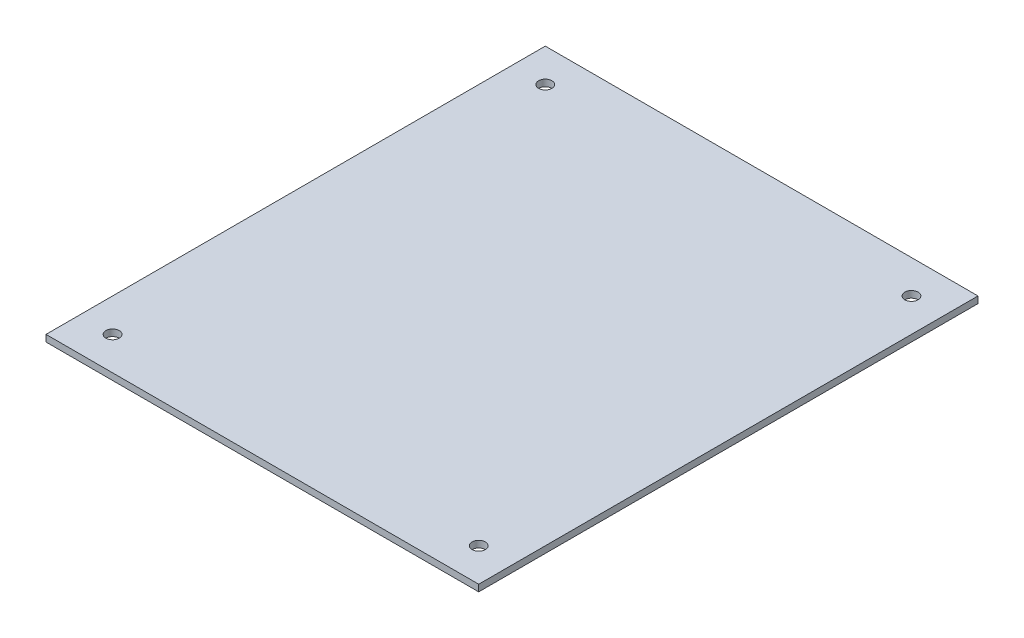
ISO-10303-21;
HEADER;
FILE_DESCRIPTION(('STEP AP214'),'2;1');
FILE_NAME('part.step','',(''),(''),'','','');
FILE_SCHEMA(('AUTOMOTIVE_DESIGN { 1 0 10303 214 1 1 1 1 }'));
ENDSEC;
DATA;
#1=APPLICATION_CONTEXT('core data for automotive mechanical design processes');
#2=APPLICATION_PROTOCOL_DEFINITION('international standard','automotive_design',2000,#1);
#3=PRODUCT_CONTEXT('',#1,'mechanical');
#4=PRODUCT('Part','Part','',(#3));
#5=PRODUCT_RELATED_PRODUCT_CATEGORY('part','',(#4));
#6=PRODUCT_DEFINITION_FORMATION('','',#4);
#7=PRODUCT_DEFINITION_CONTEXT('part definition',#1,'design');
#8=PRODUCT_DEFINITION('design','',#6,#7);
#9=PRODUCT_DEFINITION_SHAPE('','',#8);
#10=(LENGTH_UNIT() NAMED_UNIT(*) SI_UNIT(.MILLI.,.METRE.));
#11=(NAMED_UNIT(*) PLANE_ANGLE_UNIT() SI_UNIT($,.RADIAN.));
#12=(NAMED_UNIT(*) SI_UNIT($,.STERADIAN.) SOLID_ANGLE_UNIT());
#13=UNCERTAINTY_MEASURE_WITH_UNIT(LENGTH_MEASURE(1.E-05),#10,'distance_accuracy_value','');
#14=(GEOMETRIC_REPRESENTATION_CONTEXT(3) GLOBAL_UNCERTAINTY_ASSIGNED_CONTEXT((#13)) GLOBAL_UNIT_ASSIGNED_CONTEXT((#10,
#11,#12)) REPRESENTATION_CONTEXT('',''));
#15=CARTESIAN_POINT('',(0.,0.,0.));
#16=DIRECTION('',(0.,0.,1.));
#17=DIRECTION('',(1.,0.,0.));
#18=AXIS2_PLACEMENT_3D('',#15,#16,#17);
#19=CARTESIAN_POINT('',(65.,2.,75.));
#20=DIRECTION('',(-1.,0.,0.));
#21=DIRECTION('',(0.,0.,1.));
#22=AXIS2_PLACEMENT_3D('',#19,#20,#21);
#23=PLANE('',#22);
#24=DIRECTION('',(0.,0.,-1.));
#25=VECTOR('',#24,1.);
#26=CARTESIAN_POINT('',(65.,0.,75.));
#27=LINE('',#26,#25);
#28=CARTESIAN_POINT('',(65.,0.,75.));
#29=VERTEX_POINT('',#28);
#30=CARTESIAN_POINT('',(65.,0.,-75.));
#31=VERTEX_POINT('',#30);
#32=EDGE_CURVE('E96',#29,#31,#27,.T.);
#33=ORIENTED_EDGE('',*,*,#32,.T.);
#34=DIRECTION('',(0.,-1.,0.));
#35=VECTOR('',#34,1.);
#36=CARTESIAN_POINT('',(65.,2.,-75.));
#37=LINE('',#36,#35);
#38=CARTESIAN_POINT('',(65.,2.,-75.));
#39=VERTEX_POINT('',#38);
#40=EDGE_CURVE('E11',#39,#31,#37,.T.);
#41=ORIENTED_EDGE('',*,*,#40,.F.);
#42=DIRECTION('',(0.,0.,-1.));
#43=VECTOR('',#42,1.);
#44=CARTESIAN_POINT('',(65.,2.,75.));
#45=LINE('',#44,#43);
#46=CARTESIAN_POINT('',(65.,2.,75.));
#47=VERTEX_POINT('',#46);
#48=EDGE_CURVE('E84',#47,#39,#45,.T.);
#49=ORIENTED_EDGE('',*,*,#48,.F.);
#50=DIRECTION('',(0.,-1.,0.));
#51=VECTOR('',#50,1.);
#52=CARTESIAN_POINT('',(65.,2.,75.));
#53=LINE('',#52,#51);
#54=EDGE_CURVE('E92',#47,#29,#53,.T.);
#55=ORIENTED_EDGE('',*,*,#54,.T.);
#56=EDGE_LOOP('',(#33,#41,#49,#55));
#57=FACE_BOUND('',#56,.T.);
#58=ADVANCED_FACE('F33',(#57),#23,.F.);
#59=CARTESIAN_POINT('',(-65.,2.,-75.));
#60=DIRECTION('',(0.,0.,1.));
#61=DIRECTION('',(1.,0.,0.));
#62=AXIS2_PLACEMENT_3D('',#59,#60,#61);
#63=PLANE('',#62);
#64=DIRECTION('',(-1.,0.,0.));
#65=VECTOR('',#64,1.);
#66=CARTESIAN_POINT('',(-65.,0.,-75.));
#67=LINE('',#66,#65);
#68=CARTESIAN_POINT('',(-65.,0.,-75.));
#69=VERTEX_POINT('',#68);
#70=EDGE_CURVE('E88',#31,#69,#67,.T.);
#71=ORIENTED_EDGE('',*,*,#70,.T.);
#72=DIRECTION('',(0.,-1.,0.));
#73=VECTOR('',#72,1.);
#74=CARTESIAN_POINT('',(-65.,2.,-75.));
#75=LINE('',#74,#73);
#76=CARTESIAN_POINT('',(-65.,2.,-75.));
#77=VERTEX_POINT('',#76);
#78=EDGE_CURVE('E41',#77,#69,#75,.T.);
#79=ORIENTED_EDGE('',*,*,#78,.F.);
#80=DIRECTION('',(-1.,0.,0.));
#81=VECTOR('',#80,1.);
#82=CARTESIAN_POINT('',(-65.,2.,-75.));
#83=LINE('',#82,#81);
#84=EDGE_CURVE('E79',#39,#77,#83,.T.);
#85=ORIENTED_EDGE('',*,*,#84,.F.);
#86=ORIENTED_EDGE('',*,*,#40,.T.);
#87=EDGE_LOOP('',(#71,#79,#85,#86));
#88=FACE_BOUND('',#87,.T.);
#89=ADVANCED_FACE('F87',(#88),#63,.F.);
#90=CARTESIAN_POINT('',(-65.,2.,75.));
#91=DIRECTION('',(1.,0.,0.));
#92=DIRECTION('',(0.,0.,-1.));
#93=AXIS2_PLACEMENT_3D('',#90,#91,#92);
#94=PLANE('',#93);
#95=DIRECTION('',(0.,0.,1.));
#96=VECTOR('',#95,1.);
#97=CARTESIAN_POINT('',(-65.,0.,75.));
#98=LINE('',#97,#96);
#99=CARTESIAN_POINT('',(-65.,0.,75.));
#100=VERTEX_POINT('',#99);
#101=EDGE_CURVE('E66',#69,#100,#98,.T.);
#102=ORIENTED_EDGE('',*,*,#101,.T.);
#103=DIRECTION('',(0.,-1.,0.));
#104=VECTOR('',#103,1.);
#105=CARTESIAN_POINT('',(-65.,2.,75.));
#106=LINE('',#105,#104);
#107=CARTESIAN_POINT('',(-65.,2.,75.));
#108=VERTEX_POINT('',#107);
#109=EDGE_CURVE('E89',#108,#100,#106,.T.);
#110=ORIENTED_EDGE('',*,*,#109,.F.);
#111=DIRECTION('',(0.,0.,1.));
#112=VECTOR('',#111,1.);
#113=CARTESIAN_POINT('',(-65.,2.,75.));
#114=LINE('',#113,#112);
#115=EDGE_CURVE('E82',#77,#108,#114,.T.);
#116=ORIENTED_EDGE('',*,*,#115,.F.);
#117=ORIENTED_EDGE('',*,*,#78,.T.);
#118=EDGE_LOOP('',(#102,#110,#116,#117));
#119=FACE_BOUND('',#118,.T.);
#120=ADVANCED_FACE('F90',(#119),#94,.F.);
#121=CARTESIAN_POINT('',(-65.,2.,75.));
#122=DIRECTION('',(0.,0.,-1.));
#123=DIRECTION('',(-1.,0.,0.));
#124=AXIS2_PLACEMENT_3D('',#121,#122,#123);
#125=PLANE('',#124);
#126=DIRECTION('',(1.,0.,0.));
#127=VECTOR('',#126,1.);
#128=CARTESIAN_POINT('',(-65.,0.,75.));
#129=LINE('',#128,#127);
#130=EDGE_CURVE('E72',#100,#29,#129,.T.);
#131=ORIENTED_EDGE('',*,*,#130,.T.);
#132=ORIENTED_EDGE('',*,*,#54,.F.);
#133=DIRECTION('',(1.,0.,0.));
#134=VECTOR('',#133,1.);
#135=CARTESIAN_POINT('',(-65.,2.,75.));
#136=LINE('',#135,#134);
#137=EDGE_CURVE('E49',#108,#47,#136,.T.);
#138=ORIENTED_EDGE('',*,*,#137,.F.);
#139=ORIENTED_EDGE('',*,*,#109,.T.);
#140=EDGE_LOOP('',(#131,#132,#138,#139));
#141=FACE_BOUND('',#140,.T.);
#142=ADVANCED_FACE('F104',(#141),#125,.F.);
#143=CARTESIAN_POINT('',(0.,2.,0.));
#144=DIRECTION('',(0.,-1.,0.));
#145=DIRECTION('',(0.,0.,-1.));
#146=AXIS2_PLACEMENT_3D('',#143,#144,#145);
#147=PLANE('',#146);
#148=CARTESIAN_POINT('',(-55.,2.,65.));
#149=DIRECTION('',(0.,1.,0.));
#150=DIRECTION('',(0.,0.,-1.));
#151=AXIS2_PLACEMENT_3D('',#148,#149,#150);
#152=CIRCLE('',#151,2.);
#153=CARTESIAN_POINT('',(-55.,2.,63.));
#154=VERTEX_POINT('',#153);
#155=EDGE_CURVE('E128',#154,#154,#152,.T.);
#156=ORIENTED_EDGE('',*,*,#155,.F.);
#157=EDGE_LOOP('',(#156));
#158=FACE_BOUND('',#157,.T.);
#159=CARTESIAN_POINT('',(55.,2.,65.));
#160=DIRECTION('',(0.,1.,0.));
#161=DIRECTION('',(0.,0.,1.));
#162=AXIS2_PLACEMENT_3D('',#159,#160,#161);
#163=CIRCLE('',#162,2.);
#164=CARTESIAN_POINT('',(55.,2.,67.));
#165=VERTEX_POINT('',#164);
#166=EDGE_CURVE('E122',#165,#165,#163,.T.);
#167=ORIENTED_EDGE('',*,*,#166,.F.);
#168=EDGE_LOOP('',(#167));
#169=FACE_BOUND('',#168,.T.);
#170=CARTESIAN_POINT('',(55.,2.,-65.));
#171=DIRECTION('',(0.,1.,0.));
#172=DIRECTION('',(0.,0.,-1.));
#173=AXIS2_PLACEMENT_3D('',#170,#171,#172);
#174=CIRCLE('',#173,2.);
#175=CARTESIAN_POINT('',(55.,2.,-67.));
#176=VERTEX_POINT('',#175);
#177=EDGE_CURVE('E116',#176,#176,#174,.T.);
#178=ORIENTED_EDGE('',*,*,#177,.F.);
#179=EDGE_LOOP('',(#178));
#180=FACE_BOUND('',#179,.T.);
#181=CARTESIAN_POINT('',(-55.,2.,-65.));
#182=DIRECTION('',(0.,1.,0.));
#183=DIRECTION('',(0.,0.,1.));
#184=AXIS2_PLACEMENT_3D('',#181,#182,#183);
#185=CIRCLE('',#184,2.);
#186=CARTESIAN_POINT('',(-55.,2.,-63.));
#187=VERTEX_POINT('',#186);
#188=EDGE_CURVE('E110',#187,#187,#185,.T.);
#189=ORIENTED_EDGE('',*,*,#188,.F.);
#190=EDGE_LOOP('',(#189));
#191=FACE_BOUND('',#190,.T.);
#192=ORIENTED_EDGE('',*,*,#48,.T.);
#193=ORIENTED_EDGE('',*,*,#84,.T.);
#194=ORIENTED_EDGE('',*,*,#115,.T.);
#195=ORIENTED_EDGE('',*,*,#137,.T.);
#196=EDGE_LOOP('',(#192,#193,#194,#195));
#197=FACE_BOUND('',#196,.T.);
#198=ADVANCED_FACE('F80',(#158,#169,#180,#191,#197),#147,.F.);
#199=CARTESIAN_POINT('',(0.,0.,0.));
#200=DIRECTION('',(0.,-1.,0.));
#201=DIRECTION('',(0.,0.,-1.));
#202=AXIS2_PLACEMENT_3D('',#199,#200,#201);
#203=PLANE('',#202);
#204=CARTESIAN_POINT('',(-55.,0.,65.));
#205=DIRECTION('',(0.,1.,0.));
#206=DIRECTION('',(0.,0.,-1.));
#207=AXIS2_PLACEMENT_3D('',#204,#205,#206);
#208=CIRCLE('',#207,2.);
#209=CARTESIAN_POINT('',(-55.,0.,63.));
#210=VERTEX_POINT('',#209);
#211=EDGE_CURVE('E125',#210,#210,#208,.T.);
#212=ORIENTED_EDGE('',*,*,#211,.T.);
#213=EDGE_LOOP('',(#212));
#214=FACE_BOUND('',#213,.T.);
#215=CARTESIAN_POINT('',(55.,0.,65.));
#216=DIRECTION('',(0.,1.,0.));
#217=DIRECTION('',(0.,0.,1.));
#218=AXIS2_PLACEMENT_3D('',#215,#216,#217);
#219=CIRCLE('',#218,2.);
#220=CARTESIAN_POINT('',(55.,0.,67.));
#221=VERTEX_POINT('',#220);
#222=EDGE_CURVE('E119',#221,#221,#219,.T.);
#223=ORIENTED_EDGE('',*,*,#222,.T.);
#224=EDGE_LOOP('',(#223));
#225=FACE_BOUND('',#224,.T.);
#226=CARTESIAN_POINT('',(55.,0.,-65.));
#227=DIRECTION('',(0.,1.,0.));
#228=DIRECTION('',(0.,0.,-1.));
#229=AXIS2_PLACEMENT_3D('',#226,#227,#228);
#230=CIRCLE('',#229,2.);
#231=CARTESIAN_POINT('',(55.,0.,-67.));
#232=VERTEX_POINT('',#231);
#233=EDGE_CURVE('E113',#232,#232,#230,.T.);
#234=ORIENTED_EDGE('',*,*,#233,.T.);
#235=EDGE_LOOP('',(#234));
#236=FACE_BOUND('',#235,.T.);
#237=CARTESIAN_POINT('',(-55.,0.,-65.));
#238=DIRECTION('',(0.,1.,0.));
#239=DIRECTION('',(0.,0.,1.));
#240=AXIS2_PLACEMENT_3D('',#237,#238,#239);
#241=CIRCLE('',#240,2.);
#242=CARTESIAN_POINT('',(-55.,0.,-63.));
#243=VERTEX_POINT('',#242);
#244=EDGE_CURVE('E99',#243,#243,#241,.T.);
#245=ORIENTED_EDGE('',*,*,#244,.T.);
#246=EDGE_LOOP('',(#245));
#247=FACE_BOUND('',#246,.T.);
#248=ORIENTED_EDGE('',*,*,#32,.F.);
#249=ORIENTED_EDGE('',*,*,#130,.F.);
#250=ORIENTED_EDGE('',*,*,#101,.F.);
#251=ORIENTED_EDGE('',*,*,#70,.F.);
#252=EDGE_LOOP('',(#248,#249,#250,#251));
#253=FACE_BOUND('',#252,.T.);
#254=ADVANCED_FACE('F107',(#214,#225,#236,#247,#253),#203,.T.);
#255=CARTESIAN_POINT('',(-55.,0.,-65.));
#256=DIRECTION('',(0.,1.,0.));
#257=DIRECTION('',(0.,0.,1.));
#258=AXIS2_PLACEMENT_3D('',#255,#256,#257);
#259=CYLINDRICAL_SURFACE('',#258,2.);
#260=ORIENTED_EDGE('',*,*,#244,.F.);
#261=EDGE_LOOP('',(#260));
#262=FACE_BOUND('',#261,.T.);
#263=ORIENTED_EDGE('',*,*,#188,.T.);
#264=EDGE_LOOP('',(#263));
#265=FACE_BOUND('',#264,.T.);
#266=ADVANCED_FACE('F152',(#262,#265),#259,.F.);
#267=CARTESIAN_POINT('',(55.,0.,-65.));
#268=DIRECTION('',(0.,1.,0.));
#269=DIRECTION('',(0.,0.,1.));
#270=AXIS2_PLACEMENT_3D('',#267,#268,#269);
#271=CYLINDRICAL_SURFACE('',#270,2.);
#272=ORIENTED_EDGE('',*,*,#233,.F.);
#273=EDGE_LOOP('',(#272));
#274=FACE_BOUND('',#273,.T.);
#275=ORIENTED_EDGE('',*,*,#177,.T.);
#276=EDGE_LOOP('',(#275));
#277=FACE_BOUND('',#276,.T.);
#278=ADVANCED_FACE('F154',(#274,#277),#271,.F.);
#279=CARTESIAN_POINT('',(55.,0.,65.));
#280=DIRECTION('',(0.,1.,0.));
#281=DIRECTION('',(0.,0.,1.));
#282=AXIS2_PLACEMENT_3D('',#279,#280,#281);
#283=CYLINDRICAL_SURFACE('',#282,2.);
#284=ORIENTED_EDGE('',*,*,#222,.F.);
#285=EDGE_LOOP('',(#284));
#286=FACE_BOUND('',#285,.T.);
#287=ORIENTED_EDGE('',*,*,#166,.T.);
#288=EDGE_LOOP('',(#287));
#289=FACE_BOUND('',#288,.T.);
#290=ADVANCED_FACE('F139',(#286,#289),#283,.F.);
#291=CARTESIAN_POINT('',(-55.,0.,65.));
#292=DIRECTION('',(0.,1.,0.));
#293=DIRECTION('',(0.,0.,1.));
#294=AXIS2_PLACEMENT_3D('',#291,#292,#293);
#295=CYLINDRICAL_SURFACE('',#294,2.);
#296=ORIENTED_EDGE('',*,*,#211,.F.);
#297=EDGE_LOOP('',(#296));
#298=FACE_BOUND('',#297,.T.);
#299=ORIENTED_EDGE('',*,*,#155,.T.);
#300=EDGE_LOOP('',(#299));
#301=FACE_BOUND('',#300,.T.);
#302=ADVANCED_FACE('F136',(#298,#301),#295,.F.);
#303=CLOSED_SHELL('',(#58,#89,#120,#142,#198,#254,#266,#278,#290,#302));
#304=MANIFOLD_SOLID_BREP('B2',#303);
#305=ADVANCED_BREP_SHAPE_REPRESENTATION('',(#18,#304),#14);
#306=SHAPE_DEFINITION_REPRESENTATION(#9,#305);
ENDSEC;
END-ISO-10303-21;
